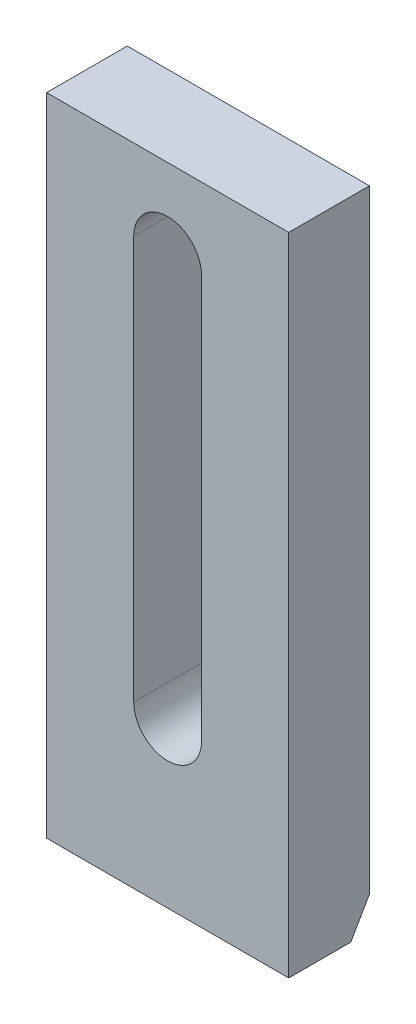
ISO-10303-21;
HEADER;
FILE_DESCRIPTION(('STEP AP214'),'2;1');
FILE_NAME('part.step','',(''),(''),'','','');
FILE_SCHEMA(('AUTOMOTIVE_DESIGN { 1 0 10303 214 1 1 1 1 }'));
ENDSEC;
DATA;
#1=APPLICATION_CONTEXT('core data for automotive mechanical design processes');
#2=APPLICATION_PROTOCOL_DEFINITION('international standard','automotive_design',2000,#1);
#3=PRODUCT_CONTEXT('',#1,'mechanical');
#4=PRODUCT('Part','Part','',(#3));
#5=PRODUCT_RELATED_PRODUCT_CATEGORY('part','',(#4));
#6=PRODUCT_DEFINITION_FORMATION('','',#4);
#7=PRODUCT_DEFINITION_CONTEXT('part definition',#1,'design');
#8=PRODUCT_DEFINITION('design','',#6,#7);
#9=PRODUCT_DEFINITION_SHAPE('','',#8);
#10=(LENGTH_UNIT() NAMED_UNIT(*) SI_UNIT(.MILLI.,.METRE.));
#11=(NAMED_UNIT(*) PLANE_ANGLE_UNIT() SI_UNIT($,.RADIAN.));
#12=(NAMED_UNIT(*) SI_UNIT($,.STERADIAN.) SOLID_ANGLE_UNIT());
#13=UNCERTAINTY_MEASURE_WITH_UNIT(LENGTH_MEASURE(1.E-05),#10,'distance_accuracy_value','');
#14=(GEOMETRIC_REPRESENTATION_CONTEXT(3) GLOBAL_UNCERTAINTY_ASSIGNED_CONTEXT((#13)) GLOBAL_UNIT_ASSIGNED_CONTEXT((#10,
#11,#12)) REPRESENTATION_CONTEXT('',''));
#15=CARTESIAN_POINT('',(0.,0.,0.));
#16=DIRECTION('',(0.,0.,1.));
#17=DIRECTION('',(1.,0.,0.));
#18=AXIS2_PLACEMENT_3D('',#15,#16,#17);
#19=CARTESIAN_POINT('',(0.,0.,25.));
#20=DIRECTION('',(1.,0.,0.));
#21=DIRECTION('',(0.,0.,-1.));
#22=AXIS2_PLACEMENT_3D('',#19,#20,#21);
#23=PLANE('',#22);
#24=DIRECTION('',(0.,-1.,0.));
#25=VECTOR('',#24,1.);
#26=CARTESIAN_POINT('',(0.,0.,0.));
#27=LINE('',#26,#25);
#28=CARTESIAN_POINT('',(0.,200.,0.));
#29=VERTEX_POINT('',#28);
#30=CARTESIAN_POINT('',(0.,10.0000000000001,0.));
#31=VERTEX_POINT('',#30);
#32=EDGE_CURVE('E201',#29,#31,#27,.T.);
#33=ORIENTED_EDGE('',*,*,#32,.T.);
#34=DIRECTION('',(0.,-0.86602540378444,0.499999999999998));
#35=VECTOR('',#34,1.);
#36=CARTESIAN_POINT('',(0.,0.,5.77350269189628));
#37=LINE('',#36,#35);
#38=CARTESIAN_POINT('',(0.,0.,5.77350269189628));
#39=VERTEX_POINT('',#38);
#40=EDGE_CURVE('E12',#31,#39,#37,.T.);
#41=ORIENTED_EDGE('',*,*,#40,.T.);
#42=DIRECTION('',(0.,0.,-1.));
#43=VECTOR('',#42,1.);
#44=CARTESIAN_POINT('',(0.,0.,25.));
#45=LINE('',#44,#43);
#46=CARTESIAN_POINT('',(0.,0.,25.));
#47=VERTEX_POINT('',#46);
#48=EDGE_CURVE('E227',#47,#39,#45,.T.);
#49=ORIENTED_EDGE('',*,*,#48,.F.);
#50=DIRECTION('',(0.,-1.,0.));
#51=VECTOR('',#50,1.);
#52=CARTESIAN_POINT('',(0.,0.,25.));
#53=LINE('',#52,#51);
#54=CARTESIAN_POINT('',(0.,200.,25.));
#55=VERTEX_POINT('',#54);
#56=EDGE_CURVE('E205',#55,#47,#53,.T.);
#57=ORIENTED_EDGE('',*,*,#56,.F.);
#58=DIRECTION('',(0.,0.,-1.));
#59=VECTOR('',#58,1.);
#60=CARTESIAN_POINT('',(0.,200.,25.));
#61=LINE('',#60,#59);
#62=EDGE_CURVE('E215',#55,#29,#61,.T.);
#63=ORIENTED_EDGE('',*,*,#62,.T.);
#64=EDGE_LOOP('',(#33,#41,#49,#57,#63));
#65=FACE_BOUND('',#64,.T.);
#66=ADVANCED_FACE('F92',(#65),#23,.F.);
#67=CARTESIAN_POINT('',(0.,0.,25.));
#68=DIRECTION('',(0.,1.,0.));
#69=DIRECTION('',(0.,0.,1.));
#70=AXIS2_PLACEMENT_3D('',#67,#68,#69);
#71=PLANE('',#70);
#72=ORIENTED_EDGE('',*,*,#48,.T.);
#73=DIRECTION('',(1.,0.,0.));
#74=VECTOR('',#73,1.);
#75=CARTESIAN_POINT('',(75.,0.,5.77350269189628));
#76=LINE('',#75,#74);
#77=CARTESIAN_POINT('',(75.,0.,5.77350269189628));
#78=VERTEX_POINT('',#77);
#79=EDGE_CURVE('E230',#39,#78,#76,.T.);
#80=ORIENTED_EDGE('',*,*,#79,.T.);
#81=DIRECTION('',(0.,0.,-1.));
#82=VECTOR('',#81,1.);
#83=CARTESIAN_POINT('',(75.,0.,25.));
#84=LINE('',#83,#82);
#85=CARTESIAN_POINT('',(75.,0.,25.));
#86=VERTEX_POINT('',#85);
#87=EDGE_CURVE('E225',#86,#78,#84,.T.);
#88=ORIENTED_EDGE('',*,*,#87,.F.);
#89=DIRECTION('',(1.,0.,0.));
#90=VECTOR('',#89,1.);
#91=CARTESIAN_POINT('',(0.,0.,25.));
#92=LINE('',#91,#90);
#93=EDGE_CURVE('E208',#47,#86,#92,.T.);
#94=ORIENTED_EDGE('',*,*,#93,.F.);
#95=EDGE_LOOP('',(#72,#80,#88,#94));
#96=FACE_BOUND('',#95,.T.);
#97=ADVANCED_FACE('F236',(#96),#71,.F.);
#98=CARTESIAN_POINT('',(75.,0.,25.));
#99=DIRECTION('',(-1.,0.,0.));
#100=DIRECTION('',(0.,0.,1.));
#101=AXIS2_PLACEMENT_3D('',#98,#99,#100);
#102=PLANE('',#101);
#103=ORIENTED_EDGE('',*,*,#87,.T.);
#104=DIRECTION('',(0.,0.86602540378444,-0.499999999999998));
#105=VECTOR('',#104,1.);
#106=CARTESIAN_POINT('',(75.,0.,5.77350269189628));
#107=LINE('',#106,#105);
#108=CARTESIAN_POINT('',(75.,10.0000000000001,0.));
#109=VERTEX_POINT('',#108);
#110=EDGE_CURVE('E114',#78,#109,#107,.T.);
#111=ORIENTED_EDGE('',*,*,#110,.T.);
#112=DIRECTION('',(0.,1.,0.));
#113=VECTOR('',#112,1.);
#114=CARTESIAN_POINT('',(75.,0.,0.));
#115=LINE('',#114,#113);
#116=CARTESIAN_POINT('',(75.,200.,0.));
#117=VERTEX_POINT('',#116);
#118=EDGE_CURVE('E217',#109,#117,#115,.T.);
#119=ORIENTED_EDGE('',*,*,#118,.T.);
#120=DIRECTION('',(0.,0.,-1.));
#121=VECTOR('',#120,1.);
#122=CARTESIAN_POINT('',(75.,200.,25.));
#123=LINE('',#122,#121);
#124=CARTESIAN_POINT('',(75.,200.,25.));
#125=VERTEX_POINT('',#124);
#126=EDGE_CURVE('E222',#125,#117,#123,.T.);
#127=ORIENTED_EDGE('',*,*,#126,.F.);
#128=DIRECTION('',(0.,1.,0.));
#129=VECTOR('',#128,1.);
#130=CARTESIAN_POINT('',(75.,0.,25.));
#131=LINE('',#130,#129);
#132=EDGE_CURVE('E211',#86,#125,#131,.T.);
#133=ORIENTED_EDGE('',*,*,#132,.F.);
#134=EDGE_LOOP('',(#103,#111,#119,#127,#133));
#135=FACE_BOUND('',#134,.T.);
#136=ADVANCED_FACE('F241',(#135),#102,.F.);
#137=CARTESIAN_POINT('',(0.,200.,25.));
#138=DIRECTION('',(0.,-1.,0.));
#139=DIRECTION('',(0.,0.,-1.));
#140=AXIS2_PLACEMENT_3D('',#137,#138,#139);
#141=PLANE('',#140);
#142=DIRECTION('',(-1.,0.,0.));
#143=VECTOR('',#142,1.);
#144=CARTESIAN_POINT('',(0.,200.,0.));
#145=LINE('',#144,#143);
#146=EDGE_CURVE('E209',#117,#29,#145,.T.);
#147=ORIENTED_EDGE('',*,*,#146,.T.);
#148=ORIENTED_EDGE('',*,*,#62,.F.);
#149=DIRECTION('',(-1.,0.,0.));
#150=VECTOR('',#149,1.);
#151=CARTESIAN_POINT('',(0.,200.,25.));
#152=LINE('',#151,#150);
#153=EDGE_CURVE('E213',#125,#55,#152,.T.);
#154=ORIENTED_EDGE('',*,*,#153,.F.);
#155=ORIENTED_EDGE('',*,*,#126,.T.);
#156=EDGE_LOOP('',(#147,#148,#154,#155));
#157=FACE_BOUND('',#156,.T.);
#158=ADVANCED_FACE('F263',(#157),#141,.F.);
#159=CARTESIAN_POINT('',(0.,0.,25.));
#160=DIRECTION('',(0.,0.,-1.));
#161=DIRECTION('',(-1.,0.,0.));
#162=AXIS2_PLACEMENT_3D('',#159,#160,#161);
#163=PLANE('',#162);
#164=DIRECTION('',(0.,1.,0.));
#165=VECTOR('',#164,1.);
#166=CARTESIAN_POINT('',(48.,50.,25.));
#167=LINE('',#166,#165);
#168=CARTESIAN_POINT('',(48.,50.,25.));
#169=VERTEX_POINT('',#168);
#170=CARTESIAN_POINT('',(48.,175.,25.));
#171=VERTEX_POINT('',#170);
#172=EDGE_CURVE('E195',#169,#171,#167,.T.);
#173=ORIENTED_EDGE('',*,*,#172,.F.);
#174=CARTESIAN_POINT('',(37.5,50.,25.));
#175=DIRECTION('',(0.,0.,1.));
#176=DIRECTION('',(1.,0.,0.));
#177=AXIS2_PLACEMENT_3D('',#174,#175,#176);
#178=CIRCLE('',#177,10.5);
#179=CARTESIAN_POINT('',(27.,50.,25.));
#180=VERTEX_POINT('',#179);
#181=EDGE_CURVE('E169',#180,#169,#178,.T.);
#182=ORIENTED_EDGE('',*,*,#181,.F.);
#183=DIRECTION('',(0.,-1.,0.));
#184=VECTOR('',#183,1.);
#185=CARTESIAN_POINT('',(27.,50.,25.));
#186=LINE('',#185,#184);
#187=CARTESIAN_POINT('',(27.,175.,25.));
#188=VERTEX_POINT('',#187);
#189=EDGE_CURVE('E186',#188,#180,#186,.T.);
#190=ORIENTED_EDGE('',*,*,#189,.F.);
#191=CARTESIAN_POINT('',(37.5,175.,25.));
#192=DIRECTION('',(0.,0.,1.));
#193=DIRECTION('',(-1.,0.,0.));
#194=AXIS2_PLACEMENT_3D('',#191,#192,#193);
#195=CIRCLE('',#194,10.5);
#196=EDGE_CURVE('E189',#171,#188,#195,.T.);
#197=ORIENTED_EDGE('',*,*,#196,.F.);
#198=EDGE_LOOP('',(#173,#182,#190,#197));
#199=FACE_BOUND('',#198,.T.);
#200=ORIENTED_EDGE('',*,*,#56,.T.);
#201=ORIENTED_EDGE('',*,*,#93,.T.);
#202=ORIENTED_EDGE('',*,*,#132,.T.);
#203=ORIENTED_EDGE('',*,*,#153,.T.);
#204=EDGE_LOOP('',(#200,#201,#202,#203));
#205=FACE_BOUND('',#204,.T.);
#206=ADVANCED_FACE('F245',(#199,#205),#163,.F.);
#207=CARTESIAN_POINT('',(0.,0.,0.));
#208=DIRECTION('',(0.,0.,-1.));
#209=DIRECTION('',(-1.,0.,0.));
#210=AXIS2_PLACEMENT_3D('',#207,#208,#209);
#211=PLANE('',#210);
#212=CARTESIAN_POINT('',(37.5,50.,0.));
#213=DIRECTION('',(0.,0.,1.));
#214=DIRECTION('',(1.,0.,0.));
#215=AXIS2_PLACEMENT_3D('',#212,#213,#214);
#216=CIRCLE('',#215,10.5);
#217=CARTESIAN_POINT('',(27.,50.,0.));
#218=VERTEX_POINT('',#217);
#219=CARTESIAN_POINT('',(48.,50.,0.));
#220=VERTEX_POINT('',#219);
#221=EDGE_CURVE('E166',#218,#220,#216,.T.);
#222=ORIENTED_EDGE('',*,*,#221,.T.);
#223=DIRECTION('',(0.,1.,0.));
#224=VECTOR('',#223,1.);
#225=CARTESIAN_POINT('',(48.,50.,0.));
#226=LINE('',#225,#224);
#227=CARTESIAN_POINT('',(48.,175.,0.));
#228=VERTEX_POINT('',#227);
#229=EDGE_CURVE('E178',#220,#228,#226,.T.);
#230=ORIENTED_EDGE('',*,*,#229,.T.);
#231=CARTESIAN_POINT('',(37.5,175.,0.));
#232=DIRECTION('',(0.,0.,1.));
#233=DIRECTION('',(-1.,0.,0.));
#234=AXIS2_PLACEMENT_3D('',#231,#232,#233);
#235=CIRCLE('',#234,10.5);
#236=CARTESIAN_POINT('',(27.,175.,0.));
#237=VERTEX_POINT('',#236);
#238=EDGE_CURVE('E182',#228,#237,#235,.T.);
#239=ORIENTED_EDGE('',*,*,#238,.T.);
#240=DIRECTION('',(0.,-1.,0.));
#241=VECTOR('',#240,1.);
#242=CARTESIAN_POINT('',(27.,50.,0.));
#243=LINE('',#242,#241);
#244=EDGE_CURVE('E174',#237,#218,#243,.T.);
#245=ORIENTED_EDGE('',*,*,#244,.T.);
#246=EDGE_LOOP('',(#222,#230,#239,#245));
#247=FACE_BOUND('',#246,.T.);
#248=ORIENTED_EDGE('',*,*,#118,.F.);
#249=DIRECTION('',(-1.,0.,0.));
#250=VECTOR('',#249,1.);
#251=CARTESIAN_POINT('',(0.,10.0000000000001,0.));
#252=LINE('',#251,#250);
#253=EDGE_CURVE('E100',#109,#31,#252,.T.);
#254=ORIENTED_EDGE('',*,*,#253,.T.);
#255=ORIENTED_EDGE('',*,*,#32,.F.);
#256=ORIENTED_EDGE('',*,*,#146,.F.);
#257=EDGE_LOOP('',(#248,#254,#255,#256));
#258=FACE_BOUND('',#257,.T.);
#259=ADVANCED_FACE('F184',(#247,#258),#211,.T.);
#260=CARTESIAN_POINT('',(37.5,50.,0.));
#261=DIRECTION('',(0.,0.,1.));
#262=DIRECTION('',(1.,0.,0.));
#263=AXIS2_PLACEMENT_3D('',#260,#261,#262);
#264=CYLINDRICAL_SURFACE('',#263,10.5);
#265=ORIENTED_EDGE('',*,*,#181,.T.);
#266=DIRECTION('',(0.,0.,1.));
#267=VECTOR('',#266,1.);
#268=CARTESIAN_POINT('',(48.,50.,0.));
#269=LINE('',#268,#267);
#270=EDGE_CURVE('E162',#220,#169,#269,.T.);
#271=ORIENTED_EDGE('',*,*,#270,.F.);
#272=ORIENTED_EDGE('',*,*,#221,.F.);
#273=DIRECTION('',(0.,0.,1.));
#274=VECTOR('',#273,1.);
#275=CARTESIAN_POINT('',(27.,50.,0.));
#276=LINE('',#275,#274);
#277=EDGE_CURVE('E199',#218,#180,#276,.T.);
#278=ORIENTED_EDGE('',*,*,#277,.T.);
#279=EDGE_LOOP('',(#265,#271,#272,#278));
#280=FACE_BOUND('',#279,.T.);
#281=ADVANCED_FACE('F164',(#280),#264,.F.);
#282=CARTESIAN_POINT('',(27.,50.,0.));
#283=DIRECTION('',(-1.,0.,0.));
#284=DIRECTION('',(0.,0.,1.));
#285=AXIS2_PLACEMENT_3D('',#282,#283,#284);
#286=PLANE('',#285);
#287=ORIENTED_EDGE('',*,*,#189,.T.);
#288=ORIENTED_EDGE('',*,*,#277,.F.);
#289=ORIENTED_EDGE('',*,*,#244,.F.);
#290=DIRECTION('',(0.,0.,1.));
#291=VECTOR('',#290,1.);
#292=CARTESIAN_POINT('',(27.,175.,0.));
#293=LINE('',#292,#291);
#294=EDGE_CURVE('E202',#237,#188,#293,.T.);
#295=ORIENTED_EDGE('',*,*,#294,.T.);
#296=EDGE_LOOP('',(#287,#288,#289,#295));
#297=FACE_BOUND('',#296,.T.);
#298=ADVANCED_FACE('F273',(#297),#286,.F.);
#299=CARTESIAN_POINT('',(37.5,175.,0.));
#300=DIRECTION('',(0.,0.,1.));
#301=DIRECTION('',(1.,0.,0.));
#302=AXIS2_PLACEMENT_3D('',#299,#300,#301);
#303=CYLINDRICAL_SURFACE('',#302,10.5);
#304=ORIENTED_EDGE('',*,*,#196,.T.);
#305=ORIENTED_EDGE('',*,*,#294,.F.);
#306=ORIENTED_EDGE('',*,*,#238,.F.);
#307=DIRECTION('',(0.,0.,1.));
#308=VECTOR('',#307,1.);
#309=CARTESIAN_POINT('',(48.,175.,0.));
#310=LINE('',#309,#308);
#311=EDGE_CURVE('E173',#228,#171,#310,.T.);
#312=ORIENTED_EDGE('',*,*,#311,.T.);
#313=EDGE_LOOP('',(#304,#305,#306,#312));
#314=FACE_BOUND('',#313,.T.);
#315=ADVANCED_FACE('F253',(#314),#303,.F.);
#316=CARTESIAN_POINT('',(48.,50.,0.));
#317=DIRECTION('',(1.,0.,0.));
#318=DIRECTION('',(0.,0.,-1.));
#319=AXIS2_PLACEMENT_3D('',#316,#317,#318);
#320=PLANE('',#319);
#321=ORIENTED_EDGE('',*,*,#172,.T.);
#322=ORIENTED_EDGE('',*,*,#311,.F.);
#323=ORIENTED_EDGE('',*,*,#229,.F.);
#324=ORIENTED_EDGE('',*,*,#270,.T.);
#325=EDGE_LOOP('',(#321,#322,#323,#324));
#326=FACE_BOUND('',#325,.T.);
#327=ADVANCED_FACE('F179',(#326),#320,.F.);
#328=CARTESIAN_POINT('',(0.,0.,5.77350269189628));
#329=DIRECTION('',(0.,-0.499999999999998,-0.86602540378444));
#330=DIRECTION('',(-1.,0.,0.));
#331=AXIS2_PLACEMENT_3D('',#328,#329,#330);
#332=PLANE('',#331);
#333=ORIENTED_EDGE('',*,*,#40,.F.);
#334=ORIENTED_EDGE('',*,*,#253,.F.);
#335=ORIENTED_EDGE('',*,*,#110,.F.);
#336=ORIENTED_EDGE('',*,*,#79,.F.);
#337=EDGE_LOOP('',(#333,#334,#335,#336));
#338=FACE_BOUND('',#337,.T.);
#339=ADVANCED_FACE('F94',(#338),#332,.T.);
#340=CLOSED_SHELL('',(#66,#97,#136,#158,#206,#259,#281,#298,#315,#327,#339));
#341=MANIFOLD_SOLID_BREP('B2',#340);
#342=ADVANCED_BREP_SHAPE_REPRESENTATION('',(#18,#341),#14);
#343=SHAPE_DEFINITION_REPRESENTATION(#9,#342);
ENDSEC;
END-ISO-10303-21;
